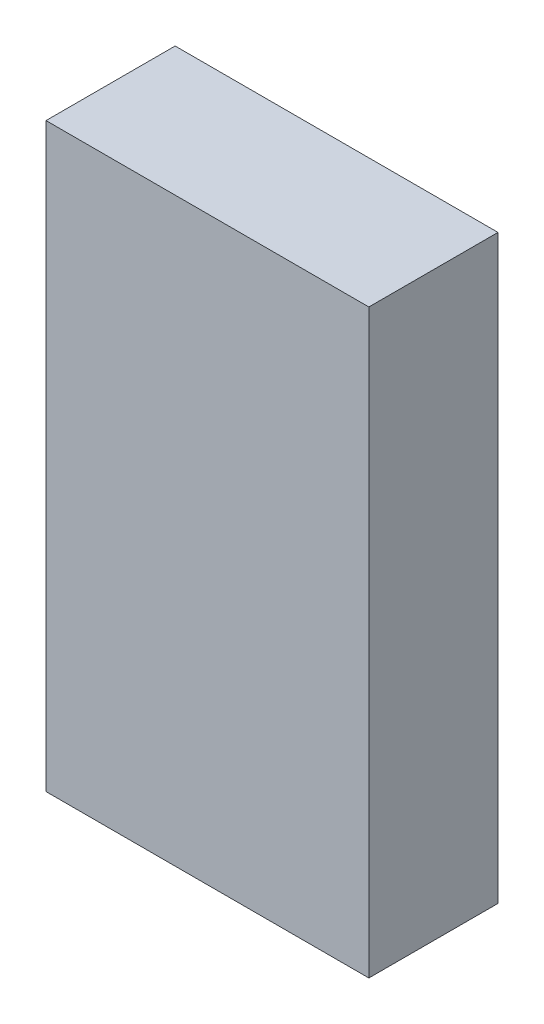
ISO-10303-21;
HEADER;
FILE_DESCRIPTION(('STEP AP214'),'2;1');
FILE_NAME('part.step','',(''),(''),'','','');
FILE_SCHEMA(('AUTOMOTIVE_DESIGN { 1 0 10303 214 1 1 1 1 }'));
ENDSEC;
DATA;
#1=APPLICATION_CONTEXT('core data for automotive mechanical design processes');
#2=APPLICATION_PROTOCOL_DEFINITION('international standard','automotive_design',2000,#1);
#3=PRODUCT_CONTEXT('',#1,'mechanical');
#4=PRODUCT('Part','Part','',(#3));
#5=PRODUCT_RELATED_PRODUCT_CATEGORY('part','',(#4));
#6=PRODUCT_DEFINITION_FORMATION('','',#4);
#7=PRODUCT_DEFINITION_CONTEXT('part definition',#1,'design');
#8=PRODUCT_DEFINITION('design','',#6,#7);
#9=PRODUCT_DEFINITION_SHAPE('','',#8);
#10=(LENGTH_UNIT() NAMED_UNIT(*) SI_UNIT(.MILLI.,.METRE.));
#11=(NAMED_UNIT(*) PLANE_ANGLE_UNIT() SI_UNIT($,.RADIAN.));
#12=(NAMED_UNIT(*) SI_UNIT($,.STERADIAN.) SOLID_ANGLE_UNIT());
#13=UNCERTAINTY_MEASURE_WITH_UNIT(LENGTH_MEASURE(1.E-05),#10,'distance_accuracy_value','');
#14=(GEOMETRIC_REPRESENTATION_CONTEXT(3) GLOBAL_UNCERTAINTY_ASSIGNED_CONTEXT((#13)) GLOBAL_UNIT_ASSIGNED_CONTEXT((#10,
#11,#12)) REPRESENTATION_CONTEXT('',''));
#15=CARTESIAN_POINT('',(0.,0.,0.));
#16=DIRECTION('',(0.,0.,1.));
#17=DIRECTION('',(1.,0.,0.));
#18=AXIS2_PLACEMENT_3D('',#15,#16,#17);
#19=CARTESIAN_POINT('',(-0.125,-2.05,0.));
#20=DIRECTION('',(1.,0.,0.));
#21=DIRECTION('',(0.,0.,1.));
#22=AXIS2_PLACEMENT_3D('',#19,#20,#21);
#23=PLANE('',#22);
#24=DIRECTION('',(0.,1.,0.));
#25=VECTOR('',#24,1.);
#26=CARTESIAN_POINT('',(-0.125,-2.05,0.1));
#27=LINE('',#26,#25);
#28=CARTESIAN_POINT('',(-0.125,-2.05,0.1));
#29=VERTEX_POINT('',#28);
#30=CARTESIAN_POINT('',(-0.125,-1.6,0.1));
#31=VERTEX_POINT('',#30);
#32=EDGE_CURVE('E11',#29,#31,#27,.T.);
#33=ORIENTED_EDGE('',*,*,#32,.T.);
#34=DIRECTION('',(0.,0.,1.));
#35=VECTOR('',#34,1.);
#36=CARTESIAN_POINT('',(-0.125,-1.6,0.));
#37=LINE('',#36,#35);
#38=CARTESIAN_POINT('',(-0.125,-1.6,0.));
#39=VERTEX_POINT('',#38);
#40=EDGE_CURVE('E24',#39,#31,#37,.T.);
#41=ORIENTED_EDGE('',*,*,#40,.F.);
#42=DIRECTION('',(0.,1.,0.));
#43=VECTOR('',#42,1.);
#44=CARTESIAN_POINT('',(-0.125,-2.05,0.));
#45=LINE('',#44,#43);
#46=CARTESIAN_POINT('',(-0.125,-2.05,0.));
#47=VERTEX_POINT('',#46);
#48=EDGE_CURVE('E86',#47,#39,#45,.T.);
#49=ORIENTED_EDGE('',*,*,#48,.F.);
#50=DIRECTION('',(0.,0.,1.));
#51=VECTOR('',#50,1.);
#52=CARTESIAN_POINT('',(-0.125,-2.05,0.));
#53=LINE('',#52,#51);
#54=EDGE_CURVE('E36',#47,#29,#53,.T.);
#55=ORIENTED_EDGE('',*,*,#54,.T.);
#56=EDGE_LOOP('',(#33,#41,#49,#55));
#57=FACE_BOUND('',#56,.T.);
#58=ADVANCED_FACE('F17',(#57),#23,.F.);
#59=CARTESIAN_POINT('',(0.125,-2.05,0.));
#60=DIRECTION('',(1.,0.,0.));
#61=DIRECTION('',(0.,0.,1.));
#62=AXIS2_PLACEMENT_3D('',#59,#60,#61);
#63=PLANE('',#62);
#64=DIRECTION('',(0.,0.,1.));
#65=VECTOR('',#64,1.);
#66=CARTESIAN_POINT('',(0.125,-2.05,0.));
#67=LINE('',#66,#65);
#68=CARTESIAN_POINT('',(0.125,-2.05,0.));
#69=VERTEX_POINT('',#68);
#70=CARTESIAN_POINT('',(0.125,-2.05,0.1));
#71=VERTEX_POINT('',#70);
#72=EDGE_CURVE('E83',#69,#71,#67,.T.);
#73=ORIENTED_EDGE('',*,*,#72,.F.);
#74=DIRECTION('',(0.,1.,0.));
#75=VECTOR('',#74,1.);
#76=CARTESIAN_POINT('',(0.125,-2.05,0.));
#77=LINE('',#76,#75);
#78=CARTESIAN_POINT('',(0.125,-1.6,0.));
#79=VERTEX_POINT('',#78);
#80=EDGE_CURVE('E63',#69,#79,#77,.T.);
#81=ORIENTED_EDGE('',*,*,#80,.T.);
#82=DIRECTION('',(0.,0.,1.));
#83=VECTOR('',#82,1.);
#84=CARTESIAN_POINT('',(0.125,-1.6,0.));
#85=LINE('',#84,#83);
#86=CARTESIAN_POINT('',(0.125,-1.6,0.1));
#87=VERTEX_POINT('',#86);
#88=EDGE_CURVE('E57',#79,#87,#85,.T.);
#89=ORIENTED_EDGE('',*,*,#88,.T.);
#90=DIRECTION('',(0.,1.,0.));
#91=VECTOR('',#90,1.);
#92=CARTESIAN_POINT('',(0.125,-2.05,0.1));
#93=LINE('',#92,#91);
#94=EDGE_CURVE('E60',#71,#87,#93,.T.);
#95=ORIENTED_EDGE('',*,*,#94,.F.);
#96=EDGE_LOOP('',(#73,#81,#89,#95));
#97=FACE_BOUND('',#96,.T.);
#98=ADVANCED_FACE('F59',(#97),#63,.T.);
#99=CARTESIAN_POINT('',(-0.125,-2.05,0.));
#100=DIRECTION('',(0.,1.,0.));
#101=DIRECTION('',(0.,0.,1.));
#102=AXIS2_PLACEMENT_3D('',#99,#100,#101);
#103=PLANE('',#102);
#104=ORIENTED_EDGE('',*,*,#72,.T.);
#105=DIRECTION('',(1.,0.,0.));
#106=VECTOR('',#105,1.);
#107=CARTESIAN_POINT('',(-0.125,-2.05,0.1));
#108=LINE('',#107,#106);
#109=EDGE_CURVE('E71',#29,#71,#108,.T.);
#110=ORIENTED_EDGE('',*,*,#109,.F.);
#111=ORIENTED_EDGE('',*,*,#54,.F.);
#112=DIRECTION('',(1.,0.,0.));
#113=VECTOR('',#112,1.);
#114=CARTESIAN_POINT('',(-0.125,-2.05,0.));
#115=LINE('',#114,#113);
#116=EDGE_CURVE('E76',#47,#69,#115,.T.);
#117=ORIENTED_EDGE('',*,*,#116,.T.);
#118=EDGE_LOOP('',(#104,#110,#111,#117));
#119=FACE_BOUND('',#118,.T.);
#120=ADVANCED_FACE('F91',(#119),#103,.F.);
#121=CARTESIAN_POINT('',(-0.125,-1.6,0.));
#122=DIRECTION('',(0.,1.,0.));
#123=DIRECTION('',(0.,0.,1.));
#124=AXIS2_PLACEMENT_3D('',#121,#122,#123);
#125=PLANE('',#124);
#126=DIRECTION('',(1.,0.,0.));
#127=VECTOR('',#126,1.);
#128=CARTESIAN_POINT('',(-0.125,-1.6,0.));
#129=LINE('',#128,#127);
#130=EDGE_CURVE('E74',#39,#79,#129,.T.);
#131=ORIENTED_EDGE('',*,*,#130,.F.);
#132=ORIENTED_EDGE('',*,*,#40,.T.);
#133=DIRECTION('',(1.,0.,0.));
#134=VECTOR('',#133,1.);
#135=CARTESIAN_POINT('',(-0.125,-1.6,0.1));
#136=LINE('',#135,#134);
#137=EDGE_CURVE('E69',#31,#87,#136,.T.);
#138=ORIENTED_EDGE('',*,*,#137,.T.);
#139=ORIENTED_EDGE('',*,*,#88,.F.);
#140=EDGE_LOOP('',(#131,#132,#138,#139));
#141=FACE_BOUND('',#140,.T.);
#142=ADVANCED_FACE('F73',(#141),#125,.T.);
#143=CARTESIAN_POINT('',(-0.125,-2.05,0.));
#144=DIRECTION('',(0.,0.,1.));
#145=DIRECTION('',(1.,0.,0.));
#146=AXIS2_PLACEMENT_3D('',#143,#144,#145);
#147=PLANE('',#146);
#148=ORIENTED_EDGE('',*,*,#130,.T.);
#149=ORIENTED_EDGE('',*,*,#80,.F.);
#150=ORIENTED_EDGE('',*,*,#116,.F.);
#151=ORIENTED_EDGE('',*,*,#48,.T.);
#152=EDGE_LOOP('',(#148,#149,#150,#151));
#153=FACE_BOUND('',#152,.T.);
#154=ADVANCED_FACE('F89',(#153),#147,.F.);
#155=CARTESIAN_POINT('',(-0.125,-2.05,0.1));
#156=DIRECTION('',(0.,0.,1.));
#157=DIRECTION('',(1.,0.,0.));
#158=AXIS2_PLACEMENT_3D('',#155,#156,#157);
#159=PLANE('',#158);
#160=ORIENTED_EDGE('',*,*,#32,.F.);
#161=ORIENTED_EDGE('',*,*,#109,.T.);
#162=ORIENTED_EDGE('',*,*,#94,.T.);
#163=ORIENTED_EDGE('',*,*,#137,.F.);
#164=EDGE_LOOP('',(#160,#161,#162,#163));
#165=FACE_BOUND('',#164,.T.);
#166=ADVANCED_FACE('F68',(#165),#159,.T.);
#167=CLOSED_SHELL('',(#58,#98,#120,#142,#154,#166));
#168=MANIFOLD_SOLID_BREP('B1',#167);
#169=ADVANCED_BREP_SHAPE_REPRESENTATION('',(#18,#168),#14);
#170=SHAPE_DEFINITION_REPRESENTATION(#9,#169);
ENDSEC;
END-ISO-10303-21;
